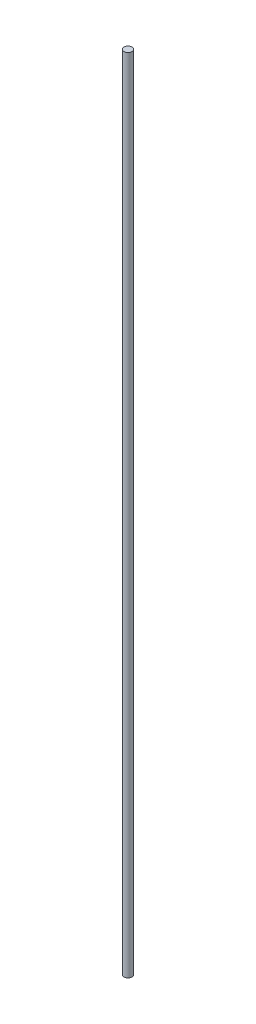
ISO-10303-21;
HEADER;
FILE_DESCRIPTION(('STEP AP214'),'2;1');
FILE_NAME('part.step','',(''),(''),'','','');
FILE_SCHEMA(('AUTOMOTIVE_DESIGN { 1 0 10303 214 1 1 1 1 }'));
ENDSEC;
DATA;
#1=APPLICATION_CONTEXT('core data for automotive mechanical design processes');
#2=APPLICATION_PROTOCOL_DEFINITION('international standard','automotive_design',2000,#1);
#3=PRODUCT_CONTEXT('',#1,'mechanical');
#4=PRODUCT('Part','Part','',(#3));
#5=PRODUCT_RELATED_PRODUCT_CATEGORY('part','',(#4));
#6=PRODUCT_DEFINITION_FORMATION('','',#4);
#7=PRODUCT_DEFINITION_CONTEXT('part definition',#1,'design');
#8=PRODUCT_DEFINITION('design','',#6,#7);
#9=PRODUCT_DEFINITION_SHAPE('','',#8);
#10=(LENGTH_UNIT() NAMED_UNIT(*) SI_UNIT(.MILLI.,.METRE.));
#11=(NAMED_UNIT(*) PLANE_ANGLE_UNIT() SI_UNIT($,.RADIAN.));
#12=(NAMED_UNIT(*) SI_UNIT($,.STERADIAN.) SOLID_ANGLE_UNIT());
#13=UNCERTAINTY_MEASURE_WITH_UNIT(LENGTH_MEASURE(1.E-05),#10,'distance_accuracy_value','');
#14=(GEOMETRIC_REPRESENTATION_CONTEXT(3) GLOBAL_UNCERTAINTY_ASSIGNED_CONTEXT((#13)) GLOBAL_UNIT_ASSIGNED_CONTEXT((#10,
#11,#12)) REPRESENTATION_CONTEXT('',''));
#15=CARTESIAN_POINT('',(0.,0.,0.));
#16=DIRECTION('',(0.,0.,1.));
#17=DIRECTION('',(1.,0.,0.));
#18=AXIS2_PLACEMENT_3D('',#15,#16,#17);
#19=CARTESIAN_POINT('',(0.,200.,0.));
#20=DIRECTION('',(0.,-1.,0.));
#21=DIRECTION('',(0.,0.,-1.));
#22=AXIS2_PLACEMENT_3D('',#19,#20,#21);
#23=CYLINDRICAL_SURFACE('',#22,1.);
#24=CARTESIAN_POINT('',(0.,200.,0.));
#25=DIRECTION('',(0.,1.,0.));
#26=DIRECTION('',(0.,0.,1.));
#27=AXIS2_PLACEMENT_3D('',#24,#25,#26);
#28=CIRCLE('',#27,1.);
#29=CARTESIAN_POINT('',(0.,200.,1.));
#30=VERTEX_POINT('',#29);
#31=EDGE_CURVE('E10',#30,#30,#28,.T.);
#32=ORIENTED_EDGE('',*,*,#31,.F.);
#33=EDGE_LOOP('',(#32));
#34=FACE_BOUND('',#33,.T.);
#35=CARTESIAN_POINT('',(0.,0.,0.));
#36=DIRECTION('',(0.,1.,0.));
#37=DIRECTION('',(0.,0.,1.));
#38=AXIS2_PLACEMENT_3D('',#35,#36,#37);
#39=CIRCLE('',#38,1.);
#40=CARTESIAN_POINT('',(0.,0.,1.));
#41=VERTEX_POINT('',#40);
#42=EDGE_CURVE('E35',#41,#41,#39,.T.);
#43=ORIENTED_EDGE('',*,*,#42,.T.);
#44=EDGE_LOOP('',(#43));
#45=FACE_BOUND('',#44,.T.);
#46=ADVANCED_FACE('F32',(#34,#45),#23,.T.);
#47=CARTESIAN_POINT('',(0.,200.,0.));
#48=DIRECTION('',(0.,1.,0.));
#49=DIRECTION('',(0.,0.,1.));
#50=AXIS2_PLACEMENT_3D('',#47,#48,#49);
#51=PLANE('',#50);
#52=ORIENTED_EDGE('',*,*,#31,.T.);
#53=EDGE_LOOP('',(#52));
#54=FACE_BOUND('',#53,.T.);
#55=ADVANCED_FACE('F47',(#54),#51,.T.);
#56=CARTESIAN_POINT('',(0.,0.,0.));
#57=DIRECTION('',(0.,1.,0.));
#58=DIRECTION('',(0.,0.,1.));
#59=AXIS2_PLACEMENT_3D('',#56,#57,#58);
#60=PLANE('',#59);
#61=ORIENTED_EDGE('',*,*,#42,.F.);
#62=EDGE_LOOP('',(#61));
#63=FACE_BOUND('',#62,.T.);
#64=ADVANCED_FACE('F45',(#63),#60,.F.);
#65=CLOSED_SHELL('',(#46,#55,#64));
#66=MANIFOLD_SOLID_BREP('B2',#65);
#67=ADVANCED_BREP_SHAPE_REPRESENTATION('',(#18,#66),#14);
#68=SHAPE_DEFINITION_REPRESENTATION(#9,#67);
ENDSEC;
END-ISO-10303-21;
